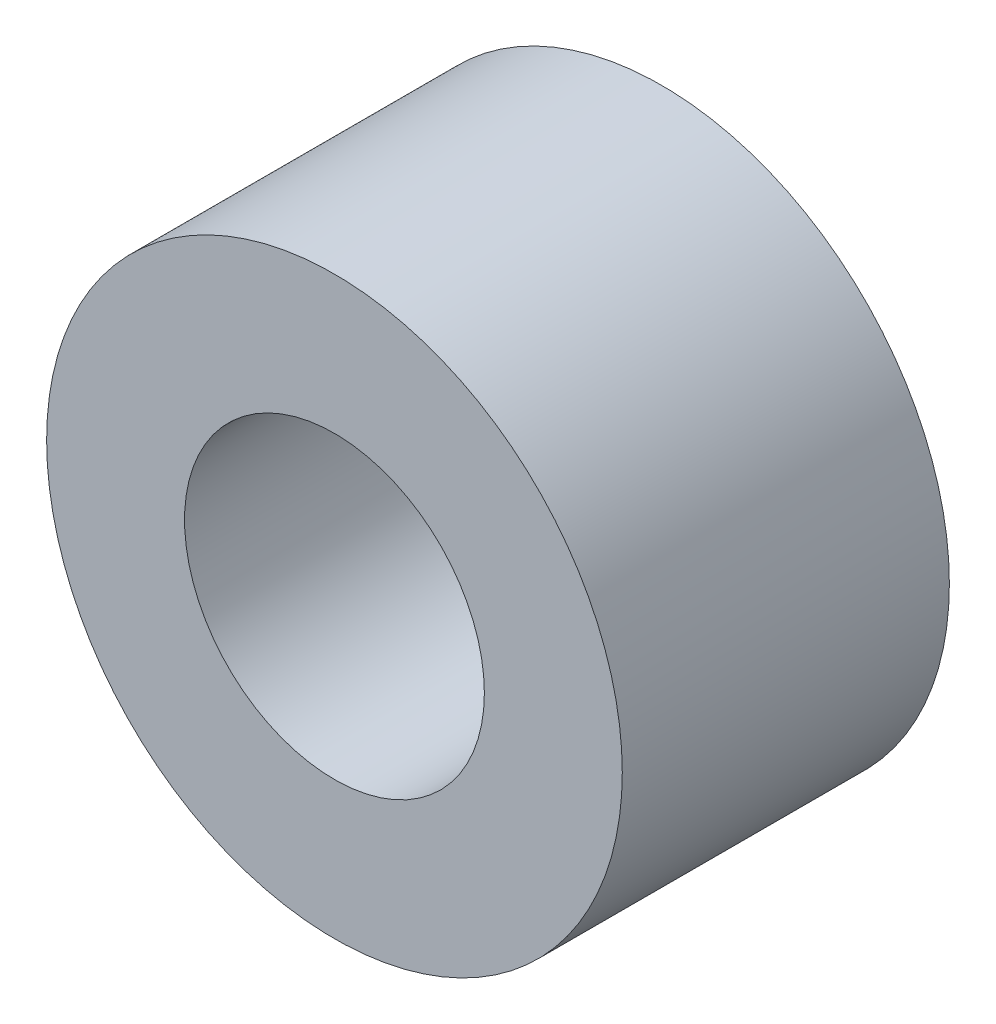
ISO-10303-21;
HEADER;
FILE_DESCRIPTION(('STEP AP214'),'2;1');
FILE_NAME('part.step','',(''),(''),'','','');
FILE_SCHEMA(('AUTOMOTIVE_DESIGN { 1 0 10303 214 1 1 1 1 }'));
ENDSEC;
DATA;
#1=APPLICATION_CONTEXT('core data for automotive mechanical design processes');
#2=APPLICATION_PROTOCOL_DEFINITION('international standard','automotive_design',2000,#1);
#3=PRODUCT_CONTEXT('',#1,'mechanical');
#4=PRODUCT('Part','Part','',(#3));
#5=PRODUCT_RELATED_PRODUCT_CATEGORY('part','',(#4));
#6=PRODUCT_DEFINITION_FORMATION('','',#4);
#7=PRODUCT_DEFINITION_CONTEXT('part definition',#1,'design');
#8=PRODUCT_DEFINITION('design','',#6,#7);
#9=PRODUCT_DEFINITION_SHAPE('','',#8);
#10=(LENGTH_UNIT() NAMED_UNIT(*) SI_UNIT(.MILLI.,.METRE.));
#11=(NAMED_UNIT(*) PLANE_ANGLE_UNIT() SI_UNIT($,.RADIAN.));
#12=(NAMED_UNIT(*) SI_UNIT($,.STERADIAN.) SOLID_ANGLE_UNIT());
#13=UNCERTAINTY_MEASURE_WITH_UNIT(LENGTH_MEASURE(1.E-05),#10,'distance_accuracy_value','');
#14=(GEOMETRIC_REPRESENTATION_CONTEXT(3) GLOBAL_UNCERTAINTY_ASSIGNED_CONTEXT((#13)) GLOBAL_UNIT_ASSIGNED_CONTEXT((#10,
#11,#12)) REPRESENTATION_CONTEXT('',''));
#15=CARTESIAN_POINT('',(0.,0.,0.));
#16=DIRECTION('',(0.,0.,1.));
#17=DIRECTION('',(1.,0.,0.));
#18=AXIS2_PLACEMENT_3D('',#15,#16,#17);
#19=CARTESIAN_POINT('',(0.,0.,9.525));
#20=DIRECTION('',(0.,0.,1.));
#21=DIRECTION('',(1.,0.,0.));
#22=AXIS2_PLACEMENT_3D('',#19,#20,#21);
#23=PLANE('',#22);
#24=CARTESIAN_POINT('',(0.,0.,9.525));
#25=DIRECTION('',(0.,0.,1.));
#26=DIRECTION('',(1.,0.,0.));
#27=AXIS2_PLACEMENT_3D('',#24,#25,#26);
#28=CIRCLE('',#27,8.382);
#29=CARTESIAN_POINT('',(8.382,0.,9.525));
#30=VERTEX_POINT('',#29);
#31=EDGE_CURVE('E10',#30,#30,#28,.T.);
#32=ORIENTED_EDGE('',*,*,#31,.T.);
#33=EDGE_LOOP('',(#32));
#34=FACE_BOUND('',#33,.T.);
#35=CARTESIAN_POINT('',(0.,0.,9.525));
#36=DIRECTION('',(0.,0.,1.));
#37=DIRECTION('',(1.,0.,0.));
#38=AXIS2_PLACEMENT_3D('',#35,#36,#37);
#39=CIRCLE('',#38,4.365625);
#40=CARTESIAN_POINT('',(4.365625,0.,9.525));
#41=VERTEX_POINT('',#40);
#42=EDGE_CURVE('E42',#41,#41,#39,.T.);
#43=ORIENTED_EDGE('',*,*,#42,.F.);
#44=EDGE_LOOP('',(#43));
#45=FACE_BOUND('',#44,.T.);
#46=ADVANCED_FACE('F31',(#34,#45),#23,.T.);
#47=CARTESIAN_POINT('',(0.,0.,0.));
#48=DIRECTION('',(0.,0.,1.));
#49=DIRECTION('',(1.,0.,0.));
#50=AXIS2_PLACEMENT_3D('',#47,#48,#49);
#51=PLANE('',#50);
#52=CARTESIAN_POINT('',(0.,0.,0.));
#53=DIRECTION('',(0.,0.,1.));
#54=DIRECTION('',(1.,0.,0.));
#55=AXIS2_PLACEMENT_3D('',#52,#53,#54);
#56=CIRCLE('',#55,8.382);
#57=CARTESIAN_POINT('',(8.382,0.,0.));
#58=VERTEX_POINT('',#57);
#59=EDGE_CURVE('E35',#58,#58,#56,.T.);
#60=ORIENTED_EDGE('',*,*,#59,.F.);
#61=EDGE_LOOP('',(#60));
#62=FACE_BOUND('',#61,.T.);
#63=CARTESIAN_POINT('',(0.,0.,0.));
#64=DIRECTION('',(0.,0.,1.));
#65=DIRECTION('',(1.,0.,0.));
#66=AXIS2_PLACEMENT_3D('',#63,#64,#65);
#67=CIRCLE('',#66,4.365625);
#68=CARTESIAN_POINT('',(4.365625,0.,0.));
#69=VERTEX_POINT('',#68);
#70=EDGE_CURVE('E44',#69,#69,#67,.T.);
#71=ORIENTED_EDGE('',*,*,#70,.T.);
#72=EDGE_LOOP('',(#71));
#73=FACE_BOUND('',#72,.T.);
#74=ADVANCED_FACE('F54',(#62,#73),#51,.F.);
#75=CARTESIAN_POINT('',(0.,0.,9.525));
#76=DIRECTION('',(0.,0.,-1.));
#77=DIRECTION('',(-1.,0.,0.));
#78=AXIS2_PLACEMENT_3D('',#75,#76,#77);
#79=CYLINDRICAL_SURFACE('',#78,8.382);
#80=ORIENTED_EDGE('',*,*,#31,.F.);
#81=EDGE_LOOP('',(#80));
#82=FACE_BOUND('',#81,.T.);
#83=ORIENTED_EDGE('',*,*,#59,.T.);
#84=EDGE_LOOP('',(#83));
#85=FACE_BOUND('',#84,.T.);
#86=ADVANCED_FACE('F33',(#82,#85),#79,.T.);
#87=CARTESIAN_POINT('',(0.,0.,9.525));
#88=DIRECTION('',(0.,0.,-1.));
#89=DIRECTION('',(-1.,0.,0.));
#90=AXIS2_PLACEMENT_3D('',#87,#88,#89);
#91=CYLINDRICAL_SURFACE('',#90,4.365625);
#92=ORIENTED_EDGE('',*,*,#42,.T.);
#93=EDGE_LOOP('',(#92));
#94=FACE_BOUND('',#93,.T.);
#95=ORIENTED_EDGE('',*,*,#70,.F.);
#96=EDGE_LOOP('',(#95));
#97=FACE_BOUND('',#96,.T.);
#98=ADVANCED_FACE('F50',(#94,#97),#91,.F.);
#99=CLOSED_SHELL('',(#46,#74,#86,#98));
#100=MANIFOLD_SOLID_BREP('B2',#99);
#101=ADVANCED_BREP_SHAPE_REPRESENTATION('',(#18,#100),#14);
#102=SHAPE_DEFINITION_REPRESENTATION(#9,#101);
ENDSEC;
END-ISO-10303-21;
